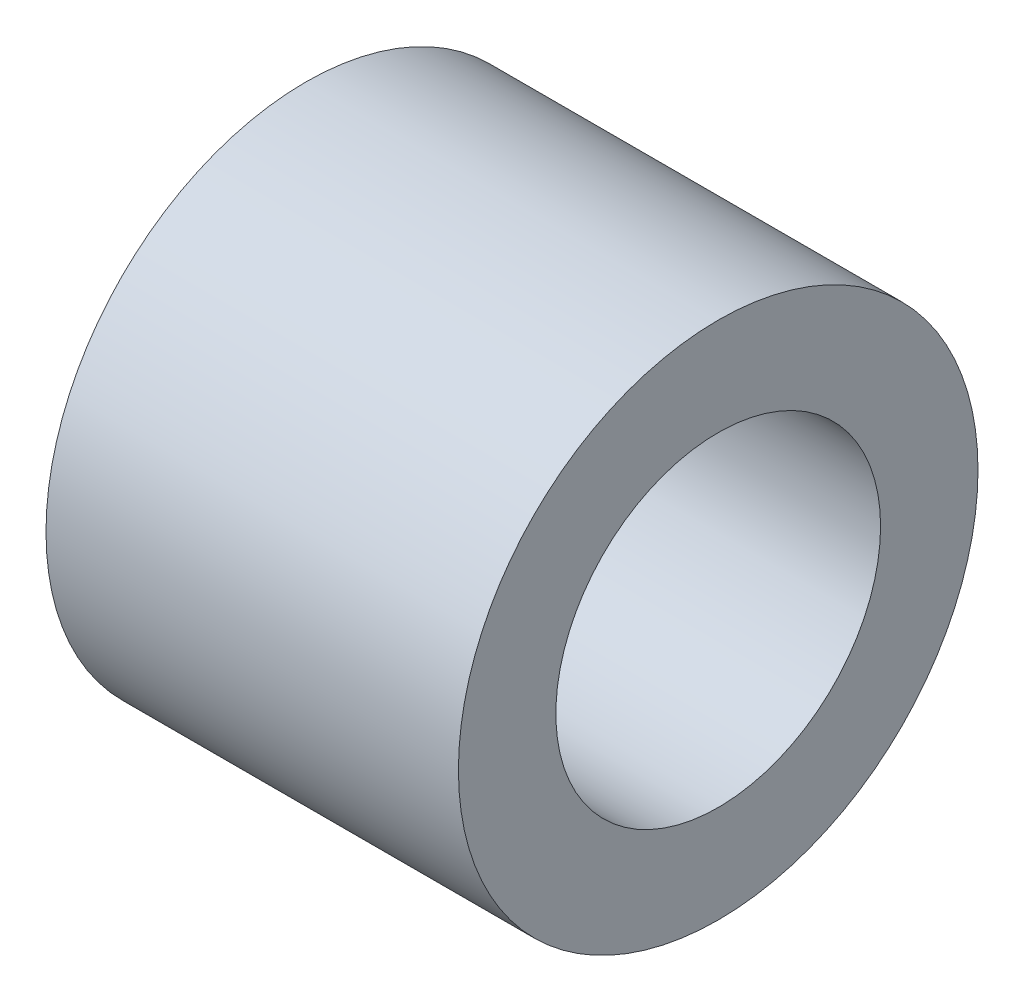
ISO-10303-21;
HEADER;
FILE_DESCRIPTION(('STEP AP214'),'2;1');
FILE_NAME('part.step','',(''),(''),'','','');
FILE_SCHEMA(('AUTOMOTIVE_DESIGN { 1 0 10303 214 1 1 1 1 }'));
ENDSEC;
DATA;
#1=APPLICATION_CONTEXT('core data for automotive mechanical design processes');
#2=APPLICATION_PROTOCOL_DEFINITION('international standard','automotive_design',2000,#1);
#3=PRODUCT_CONTEXT('',#1,'mechanical');
#4=PRODUCT('Part','Part','',(#3));
#5=PRODUCT_RELATED_PRODUCT_CATEGORY('part','',(#4));
#6=PRODUCT_DEFINITION_FORMATION('','',#4);
#7=PRODUCT_DEFINITION_CONTEXT('part definition',#1,'design');
#8=PRODUCT_DEFINITION('design','',#6,#7);
#9=PRODUCT_DEFINITION_SHAPE('','',#8);
#10=(LENGTH_UNIT() NAMED_UNIT(*) SI_UNIT(.MILLI.,.METRE.));
#11=(NAMED_UNIT(*) PLANE_ANGLE_UNIT() SI_UNIT($,.RADIAN.));
#12=(NAMED_UNIT(*) SI_UNIT($,.STERADIAN.) SOLID_ANGLE_UNIT());
#13=UNCERTAINTY_MEASURE_WITH_UNIT(LENGTH_MEASURE(1.E-05),#10,'distance_accuracy_value','');
#14=(GEOMETRIC_REPRESENTATION_CONTEXT(3) GLOBAL_UNCERTAINTY_ASSIGNED_CONTEXT((#13)) GLOBAL_UNIT_ASSIGNED_CONTEXT((#10,
#11,#12)) REPRESENTATION_CONTEXT('',''));
#15=CARTESIAN_POINT('',(0.,0.,0.));
#16=DIRECTION('',(0.,0.,1.));
#17=DIRECTION('',(1.,0.,0.));
#18=AXIS2_PLACEMENT_3D('',#15,#16,#17);
#19=CARTESIAN_POINT('',(3.175,2.5,0.));
#20=DIRECTION('',(1.,0.,0.));
#21=DIRECTION('',(0.,0.,-1.));
#22=AXIS2_PLACEMENT_3D('',#19,#20,#21);
#23=PLANE('',#22);
#24=CARTESIAN_POINT('',(3.175,0.,0.));
#25=DIRECTION('',(1.,0.,0.));
#26=DIRECTION('',(0.,0.,-1.));
#27=AXIS2_PLACEMENT_3D('',#24,#25,#26);
#28=CIRCLE('',#27,4.);
#29=CARTESIAN_POINT('',(3.175,0.,-4.));
#30=VERTEX_POINT('',#29);
#31=EDGE_CURVE('E10',#30,#30,#28,.T.);
#32=ORIENTED_EDGE('',*,*,#31,.T.);
#33=EDGE_LOOP('',(#32));
#34=FACE_BOUND('',#33,.T.);
#35=CARTESIAN_POINT('',(3.175,0.,0.));
#36=DIRECTION('',(1.,0.,0.));
#37=DIRECTION('',(0.,0.,-1.));
#38=AXIS2_PLACEMENT_3D('',#35,#36,#37);
#39=CIRCLE('',#38,2.5);
#40=CARTESIAN_POINT('',(3.175,0.,-2.5));
#41=VERTEX_POINT('',#40);
#42=EDGE_CURVE('E45',#41,#41,#39,.T.);
#43=ORIENTED_EDGE('',*,*,#42,.F.);
#44=EDGE_LOOP('',(#43));
#45=FACE_BOUND('',#44,.T.);
#46=ADVANCED_FACE('F31',(#34,#45),#23,.T.);
#47=CARTESIAN_POINT('',(0.,0.,0.));
#48=DIRECTION('',(1.,0.,0.));
#49=DIRECTION('',(0.,0.,-1.));
#50=AXIS2_PLACEMENT_3D('',#47,#48,#49);
#51=CYLINDRICAL_SURFACE('',#50,4.);
#52=CARTESIAN_POINT('',(-3.175,0.,0.));
#53=DIRECTION('',(1.,0.,0.));
#54=DIRECTION('',(0.,0.,-1.));
#55=AXIS2_PLACEMENT_3D('',#52,#53,#54);
#56=CIRCLE('',#55,4.);
#57=CARTESIAN_POINT('',(-3.175,0.,-4.));
#58=VERTEX_POINT('',#57);
#59=EDGE_CURVE('E37',#58,#58,#56,.T.);
#60=ORIENTED_EDGE('',*,*,#59,.T.);
#61=EDGE_LOOP('',(#60));
#62=FACE_BOUND('',#61,.T.);
#63=ORIENTED_EDGE('',*,*,#31,.F.);
#64=EDGE_LOOP('',(#63));
#65=FACE_BOUND('',#64,.T.);
#66=ADVANCED_FACE('F55',(#62,#65),#51,.T.);
#67=CARTESIAN_POINT('',(-3.175,4.,0.));
#68=DIRECTION('',(-1.,0.,0.));
#69=DIRECTION('',(0.,0.,1.));
#70=AXIS2_PLACEMENT_3D('',#67,#68,#69);
#71=PLANE('',#70);
#72=CARTESIAN_POINT('',(-3.175,0.,0.));
#73=DIRECTION('',(1.,0.,0.));
#74=DIRECTION('',(0.,0.,-1.));
#75=AXIS2_PLACEMENT_3D('',#72,#73,#74);
#76=CIRCLE('',#75,2.5);
#77=CARTESIAN_POINT('',(-3.175,0.,-2.5));
#78=VERTEX_POINT('',#77);
#79=EDGE_CURVE('E41',#78,#78,#76,.T.);
#80=ORIENTED_EDGE('',*,*,#79,.T.);
#81=EDGE_LOOP('',(#80));
#82=FACE_BOUND('',#81,.T.);
#83=ORIENTED_EDGE('',*,*,#59,.F.);
#84=EDGE_LOOP('',(#83));
#85=FACE_BOUND('',#84,.T.);
#86=ADVANCED_FACE('F59',(#82,#85),#71,.T.);
#87=CARTESIAN_POINT('',(0.,0.,0.));
#88=DIRECTION('',(1.,0.,0.));
#89=DIRECTION('',(0.,0.,-1.));
#90=AXIS2_PLACEMENT_3D('',#87,#88,#89);
#91=CYLINDRICAL_SURFACE('',#90,2.5);
#92=ORIENTED_EDGE('',*,*,#42,.T.);
#93=EDGE_LOOP('',(#92));
#94=FACE_BOUND('',#93,.T.);
#95=ORIENTED_EDGE('',*,*,#79,.F.);
#96=EDGE_LOOP('',(#95));
#97=FACE_BOUND('',#96,.T.);
#98=ADVANCED_FACE('F51',(#94,#97),#91,.F.);
#99=CLOSED_SHELL('',(#46,#66,#86,#98));
#100=MANIFOLD_SOLID_BREP('B2',#99);
#101=ADVANCED_BREP_SHAPE_REPRESENTATION('',(#18,#100),#14);
#102=SHAPE_DEFINITION_REPRESENTATION(#9,#101);
ENDSEC;
END-ISO-10303-21;
